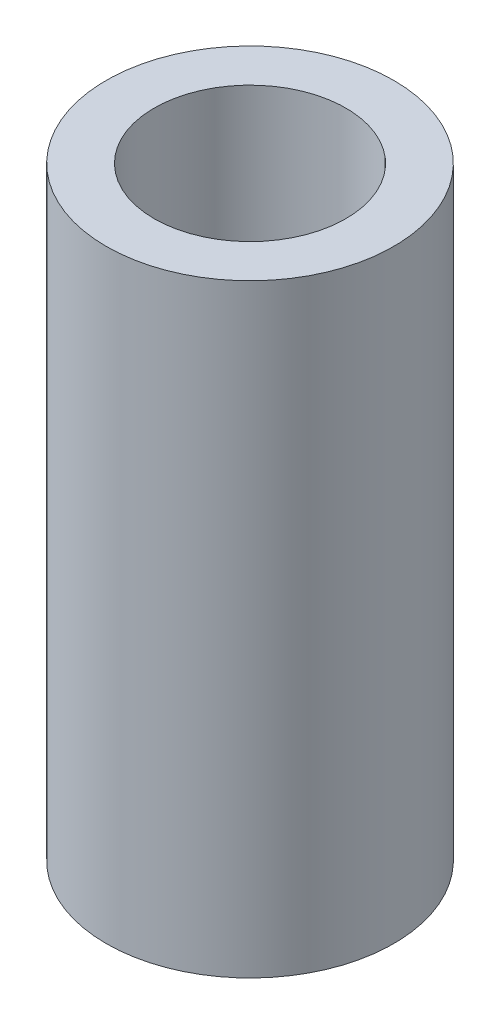
ISO-10303-21;
HEADER;
FILE_DESCRIPTION(('STEP AP214'),'2;1');
FILE_NAME('part.step','',(''),(''),'','','');
FILE_SCHEMA(('AUTOMOTIVE_DESIGN { 1 0 10303 214 1 1 1 1 }'));
ENDSEC;
DATA;
#1=APPLICATION_CONTEXT('core data for automotive mechanical design processes');
#2=APPLICATION_PROTOCOL_DEFINITION('international standard','automotive_design',2000,#1);
#3=PRODUCT_CONTEXT('',#1,'mechanical');
#4=PRODUCT('Part','Part','',(#3));
#5=PRODUCT_RELATED_PRODUCT_CATEGORY('part','',(#4));
#6=PRODUCT_DEFINITION_FORMATION('','',#4);
#7=PRODUCT_DEFINITION_CONTEXT('part definition',#1,'design');
#8=PRODUCT_DEFINITION('design','',#6,#7);
#9=PRODUCT_DEFINITION_SHAPE('','',#8);
#10=(LENGTH_UNIT() NAMED_UNIT(*) SI_UNIT(.MILLI.,.METRE.));
#11=(NAMED_UNIT(*) PLANE_ANGLE_UNIT() SI_UNIT($,.RADIAN.));
#12=(NAMED_UNIT(*) SI_UNIT($,.STERADIAN.) SOLID_ANGLE_UNIT());
#13=UNCERTAINTY_MEASURE_WITH_UNIT(LENGTH_MEASURE(1.E-05),#10,'distance_accuracy_value','');
#14=(GEOMETRIC_REPRESENTATION_CONTEXT(3) GLOBAL_UNCERTAINTY_ASSIGNED_CONTEXT((#13)) GLOBAL_UNIT_ASSIGNED_CONTEXT((#10,
#11,#12)) REPRESENTATION_CONTEXT('',''));
#15=CARTESIAN_POINT('',(0.,0.,0.));
#16=DIRECTION('',(0.,0.,1.));
#17=DIRECTION('',(1.,0.,0.));
#18=AXIS2_PLACEMENT_3D('',#15,#16,#17);
#19=CARTESIAN_POINT('',(0.,0.,-8.));
#20=DIRECTION('',(0.,1.,0.));
#21=DIRECTION('',(0.,0.,1.));
#22=AXIS2_PLACEMENT_3D('',#19,#20,#21);
#23=CYLINDRICAL_SURFACE('',#22,4.7625);
#24=CARTESIAN_POINT('',(0.,20.,-8.));
#25=DIRECTION('',(0.,1.,0.));
#26=DIRECTION('',(0.,0.,1.));
#27=AXIS2_PLACEMENT_3D('',#24,#25,#26);
#28=CIRCLE('',#27,4.7625);
#29=CARTESIAN_POINT('',(0.,20.,-3.2375));
#30=VERTEX_POINT('',#29);
#31=EDGE_CURVE('E57',#30,#30,#28,.T.);
#32=ORIENTED_EDGE('',*,*,#31,.F.);
#33=EDGE_LOOP('',(#32));
#34=FACE_BOUND('',#33,.T.);
#35=CARTESIAN_POINT('',(0.,0.,-8.));
#36=DIRECTION('',(0.,1.,0.));
#37=DIRECTION('',(0.,0.,1.));
#38=AXIS2_PLACEMENT_3D('',#35,#36,#37);
#39=CIRCLE('',#38,4.7625);
#40=CARTESIAN_POINT('',(0.,0.,-3.2375));
#41=VERTEX_POINT('',#40);
#42=EDGE_CURVE('E46',#41,#41,#39,.T.);
#43=ORIENTED_EDGE('',*,*,#42,.T.);
#44=EDGE_LOOP('',(#43));
#45=FACE_BOUND('',#44,.T.);
#46=ADVANCED_FACE('F43',(#34,#45),#23,.T.);
#47=CARTESIAN_POINT('',(0.,0.,-8.));
#48=DIRECTION('',(0.,1.,0.));
#49=DIRECTION('',(0.,0.,1.));
#50=AXIS2_PLACEMENT_3D('',#47,#48,#49);
#51=PLANE('',#50);
#52=CARTESIAN_POINT('',(0.,0.,-8.));
#53=DIRECTION('',(0.,1.,0.));
#54=DIRECTION('',(0.,0.,1.));
#55=AXIS2_PLACEMENT_3D('',#52,#53,#54);
#56=CIRCLE('',#55,3.175);
#57=CARTESIAN_POINT('',(0.,0.,-4.825));
#58=VERTEX_POINT('',#57);
#59=EDGE_CURVE('E51',#58,#58,#56,.F.);
#60=ORIENTED_EDGE('',*,*,#59,.F.);
#61=EDGE_LOOP('',(#60));
#62=FACE_BOUND('',#61,.T.);
#63=ORIENTED_EDGE('',*,*,#42,.F.);
#64=EDGE_LOOP('',(#63));
#65=FACE_BOUND('',#64,.T.);
#66=ADVANCED_FACE('F68',(#62,#65),#51,.F.);
#67=CARTESIAN_POINT('',(0.,20.,-8.));
#68=DIRECTION('',(0.,1.,0.));
#69=DIRECTION('',(0.,0.,1.));
#70=AXIS2_PLACEMENT_3D('',#67,#68,#69);
#71=PLANE('',#70);
#72=CARTESIAN_POINT('',(0.,20.,-8.));
#73=DIRECTION('',(0.,1.,0.));
#74=DIRECTION('',(0.,0.,1.));
#75=AXIS2_PLACEMENT_3D('',#72,#73,#74);
#76=CIRCLE('',#75,3.175);
#77=CARTESIAN_POINT('',(0.,20.,-4.825));
#78=VERTEX_POINT('',#77);
#79=EDGE_CURVE('E10',#78,#78,#76,.F.);
#80=ORIENTED_EDGE('',*,*,#79,.T.);
#81=EDGE_LOOP('',(#80));
#82=FACE_BOUND('',#81,.T.);
#83=ORIENTED_EDGE('',*,*,#31,.T.);
#84=EDGE_LOOP('',(#83));
#85=FACE_BOUND('',#84,.T.);
#86=ADVANCED_FACE('F70',(#82,#85),#71,.T.);
#87=CARTESIAN_POINT('',(0.,0.,-8.));
#88=DIRECTION('',(0.,1.,0.));
#89=DIRECTION('',(0.,0.,1.));
#90=AXIS2_PLACEMENT_3D('',#87,#88,#89);
#91=CYLINDRICAL_SURFACE('',#90,3.175);
#92=ORIENTED_EDGE('',*,*,#79,.F.);
#93=EDGE_LOOP('',(#92));
#94=FACE_BOUND('',#93,.T.);
#95=ORIENTED_EDGE('',*,*,#59,.T.);
#96=EDGE_LOOP('',(#95));
#97=FACE_BOUND('',#96,.T.);
#98=ADVANCED_FACE('F76',(#94,#97),#91,.F.);
#99=CLOSED_SHELL('',(#46,#66,#86,#98));
#100=MANIFOLD_SOLID_BREP('B2',#99);
#101=ADVANCED_BREP_SHAPE_REPRESENTATION('',(#18,#100),#14);
#102=SHAPE_DEFINITION_REPRESENTATION(#9,#101);
ENDSEC;
END-ISO-10303-21;
